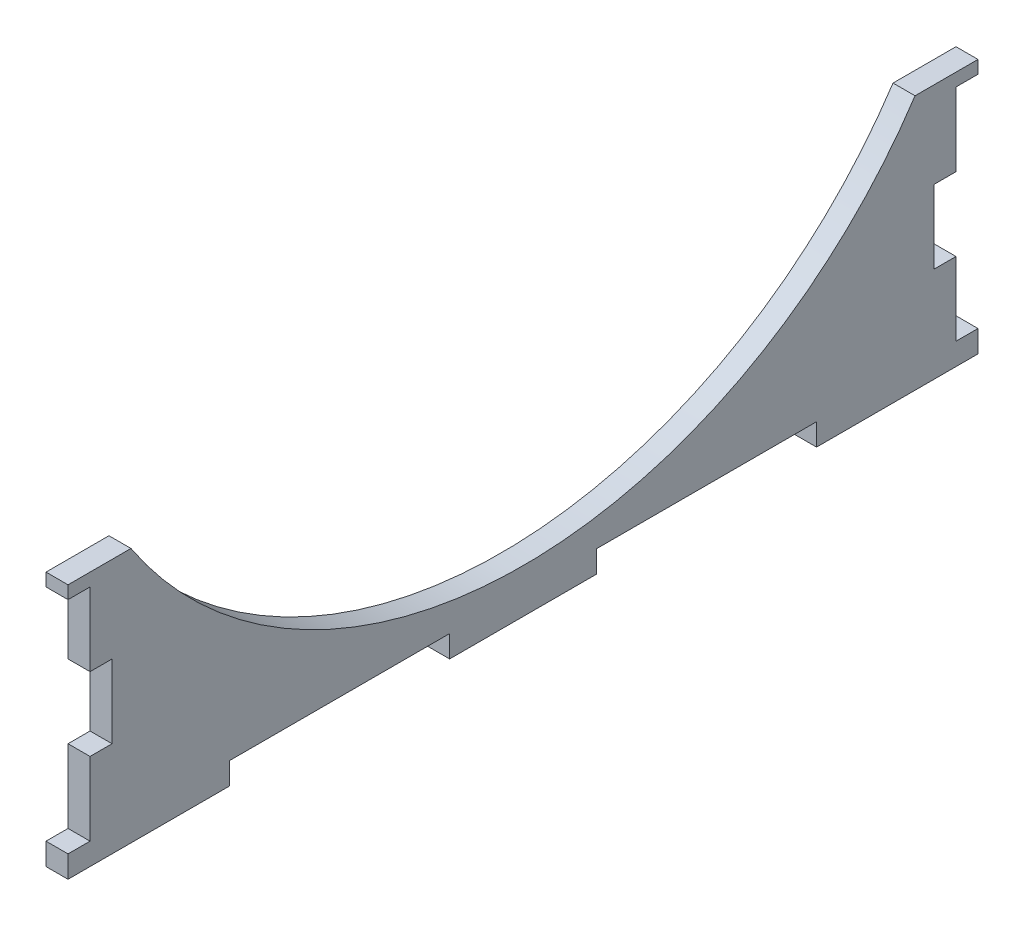
ISO-10303-21;
HEADER;
FILE_DESCRIPTION(('STEP AP214'),'2;1');
FILE_NAME('part.step','',(''),(''),'','','');
FILE_SCHEMA(('AUTOMOTIVE_DESIGN { 1 0 10303 214 1 1 1 1 }'));
ENDSEC;
DATA;
#1=APPLICATION_CONTEXT('core data for automotive mechanical design processes');
#2=APPLICATION_PROTOCOL_DEFINITION('international standard','automotive_design',2000,#1);
#3=PRODUCT_CONTEXT('',#1,'mechanical');
#4=PRODUCT('Part','Part','',(#3));
#5=PRODUCT_RELATED_PRODUCT_CATEGORY('part','',(#4));
#6=PRODUCT_DEFINITION_FORMATION('','',#4);
#7=PRODUCT_DEFINITION_CONTEXT('part definition',#1,'design');
#8=PRODUCT_DEFINITION('design','',#6,#7);
#9=PRODUCT_DEFINITION_SHAPE('','',#8);
#10=(LENGTH_UNIT() NAMED_UNIT(*) SI_UNIT(.MILLI.,.METRE.));
#11=(NAMED_UNIT(*) PLANE_ANGLE_UNIT() SI_UNIT($,.RADIAN.));
#12=(NAMED_UNIT(*) SI_UNIT($,.STERADIAN.) SOLID_ANGLE_UNIT());
#13=UNCERTAINTY_MEASURE_WITH_UNIT(LENGTH_MEASURE(1.E-05),#10,'distance_accuracy_value','');
#14=(GEOMETRIC_REPRESENTATION_CONTEXT(3) GLOBAL_UNCERTAINTY_ASSIGNED_CONTEXT((#13)) GLOBAL_UNIT_ASSIGNED_CONTEXT((#10,
#11,#12)) REPRESENTATION_CONTEXT('',''));
#15=CARTESIAN_POINT('',(0.,0.,0.));
#16=DIRECTION('',(0.,0.,1.));
#17=DIRECTION('',(1.,0.,0.));
#18=AXIS2_PLACEMENT_3D('',#15,#16,#17);
#19=CARTESIAN_POINT('',(-3.,0.,-3.00000000000028));
#20=DIRECTION('',(0.,0.,1.));
#21=DIRECTION('',(1.,0.,0.));
#22=AXIS2_PLACEMENT_3D('',#19,#20,#21);
#23=PLANE('',#22);
#24=DIRECTION('',(0.,-1.,0.));
#25=VECTOR('',#24,1.);
#26=CARTESIAN_POINT('',(0.,0.,-3.00000000000028));
#27=LINE('',#26,#25);
#28=CARTESIAN_POINT('',(0.,0.,-3.00000000000028));
#29=VERTEX_POINT('',#28);
#30=CARTESIAN_POINT('',(0.,-3.,-3.00000000000028));
#31=VERTEX_POINT('',#30);
#32=EDGE_CURVE('E266',#29,#31,#27,.T.);
#33=ORIENTED_EDGE('',*,*,#32,.T.);
#34=DIRECTION('',(1.,0.,0.));
#35=VECTOR('',#34,1.);
#36=CARTESIAN_POINT('',(-3.,-3.,-3.00000000000028));
#37=LINE('',#36,#35);
#38=CARTESIAN_POINT('',(-3.,-3.,-3.00000000000028));
#39=VERTEX_POINT('',#38);
#40=EDGE_CURVE('E11',#39,#31,#37,.T.);
#41=ORIENTED_EDGE('',*,*,#40,.F.);
#42=DIRECTION('',(0.,-1.,0.));
#43=VECTOR('',#42,1.);
#44=CARTESIAN_POINT('',(-3.,0.,-3.00000000000028));
#45=LINE('',#44,#43);
#46=CARTESIAN_POINT('',(-3.,0.,-3.00000000000028));
#47=VERTEX_POINT('',#46);
#48=EDGE_CURVE('E66',#47,#39,#45,.T.);
#49=ORIENTED_EDGE('',*,*,#48,.F.);
#50=DIRECTION('',(1.,0.,0.));
#51=VECTOR('',#50,1.);
#52=CARTESIAN_POINT('',(-3.,0.,-3.00000000000028));
#53=LINE('',#52,#51);
#54=EDGE_CURVE('E43',#47,#29,#53,.T.);
#55=ORIENTED_EDGE('',*,*,#54,.T.);
#56=EDGE_LOOP('',(#33,#41,#49,#55));
#57=FACE_BOUND('',#56,.T.);
#58=ADVANCED_FACE('F40',(#57),#23,.F.);
#59=CARTESIAN_POINT('',(-3.,-3.,0.));
#60=DIRECTION('',(0.,-1.,0.));
#61=DIRECTION('',(0.,0.,-1.));
#62=AXIS2_PLACEMENT_3D('',#59,#60,#61);
#63=PLANE('',#62);
#64=DIRECTION('',(0.,0.,-1.));
#65=VECTOR('',#64,1.);
#66=CARTESIAN_POINT('',(0.,-3.,0.));
#67=LINE('',#66,#65);
#68=CARTESIAN_POINT('',(0.,-3.,18.9999999999997));
#69=VERTEX_POINT('',#68);
#70=EDGE_CURVE('E361',#69,#31,#67,.T.);
#71=ORIENTED_EDGE('',*,*,#70,.F.);
#72=DIRECTION('',(1.,0.,0.));
#73=VECTOR('',#72,1.);
#74=CARTESIAN_POINT('',(-3.,-3.,18.9999999999997));
#75=LINE('',#74,#73);
#76=CARTESIAN_POINT('',(-3.,-3.,18.9999999999997));
#77=VERTEX_POINT('',#76);
#78=EDGE_CURVE('E49',#77,#69,#75,.T.);
#79=ORIENTED_EDGE('',*,*,#78,.F.);
#80=DIRECTION('',(0.,0.,-1.));
#81=VECTOR('',#80,1.);
#82=CARTESIAN_POINT('',(-3.,-3.,0.));
#83=LINE('',#82,#81);
#84=EDGE_CURVE('E251',#77,#39,#83,.T.);
#85=ORIENTED_EDGE('',*,*,#84,.T.);
#86=ORIENTED_EDGE('',*,*,#40,.T.);
#87=EDGE_LOOP('',(#71,#79,#85,#86));
#88=FACE_BOUND('',#87,.T.);
#89=ADVANCED_FACE('F457',(#88),#63,.T.);
#90=CARTESIAN_POINT('',(-3.,0.,18.9999999999997));
#91=DIRECTION('',(0.,0.,1.));
#92=DIRECTION('',(1.,0.,0.));
#93=AXIS2_PLACEMENT_3D('',#90,#91,#92);
#94=PLANE('',#93);
#95=DIRECTION('',(0.,-1.,0.));
#96=VECTOR('',#95,1.);
#97=CARTESIAN_POINT('',(0.,0.,18.9999999999997));
#98=LINE('',#97,#96);
#99=CARTESIAN_POINT('',(0.,0.,18.9999999999997));
#100=VERTEX_POINT('',#99);
#101=EDGE_CURVE('E237',#100,#69,#98,.T.);
#102=ORIENTED_EDGE('',*,*,#101,.F.);
#103=DIRECTION('',(1.,0.,0.));
#104=VECTOR('',#103,1.);
#105=CARTESIAN_POINT('',(-3.,0.,18.9999999999997));
#106=LINE('',#105,#104);
#107=CARTESIAN_POINT('',(-3.,0.,18.9999999999997));
#108=VERTEX_POINT('',#107);
#109=EDGE_CURVE('E232',#108,#100,#106,.T.);
#110=ORIENTED_EDGE('',*,*,#109,.F.);
#111=DIRECTION('',(0.,-1.,0.));
#112=VECTOR('',#111,1.);
#113=CARTESIAN_POINT('',(-3.,0.,18.9999999999997));
#114=LINE('',#113,#112);
#115=EDGE_CURVE('E235',#108,#77,#114,.T.);
#116=ORIENTED_EDGE('',*,*,#115,.T.);
#117=ORIENTED_EDGE('',*,*,#78,.T.);
#118=EDGE_LOOP('',(#102,#110,#116,#117));
#119=FACE_BOUND('',#118,.T.);
#120=ADVANCED_FACE('F234',(#119),#94,.T.);
#121=CARTESIAN_POINT('',(-3.,0.,0.));
#122=DIRECTION('',(0.,-1.,0.));
#123=DIRECTION('',(0.,0.,-1.));
#124=AXIS2_PLACEMENT_3D('',#121,#122,#123);
#125=PLANE('',#124);
#126=DIRECTION('',(0.,0.,-1.));
#127=VECTOR('',#126,1.);
#128=CARTESIAN_POINT('',(0.,0.,0.));
#129=LINE('',#128,#127);
#130=CARTESIAN_POINT('',(0.,0.,48.9999999999997));
#131=VERTEX_POINT('',#130);
#132=EDGE_CURVE('E356',#131,#100,#129,.T.);
#133=ORIENTED_EDGE('',*,*,#132,.F.);
#134=DIRECTION('',(1.,0.,0.));
#135=VECTOR('',#134,1.);
#136=CARTESIAN_POINT('',(-3.,0.,48.9999999999997));
#137=LINE('',#136,#135);
#138=CARTESIAN_POINT('',(-3.,0.,48.9999999999997));
#139=VERTEX_POINT('',#138);
#140=EDGE_CURVE('E243',#139,#131,#137,.T.);
#141=ORIENTED_EDGE('',*,*,#140,.F.);
#142=DIRECTION('',(0.,0.,-1.));
#143=VECTOR('',#142,1.);
#144=CARTESIAN_POINT('',(-3.,0.,0.));
#145=LINE('',#144,#143);
#146=EDGE_CURVE('E249',#139,#108,#145,.T.);
#147=ORIENTED_EDGE('',*,*,#146,.T.);
#148=ORIENTED_EDGE('',*,*,#109,.T.);
#149=EDGE_LOOP('',(#133,#141,#147,#148));
#150=FACE_BOUND('',#149,.T.);
#151=ADVANCED_FACE('F254',(#150),#125,.T.);
#152=CARTESIAN_POINT('',(-3.,0.,48.9999999999997));
#153=DIRECTION('',(0.,0.,-1.));
#154=DIRECTION('',(-1.,0.,0.));
#155=AXIS2_PLACEMENT_3D('',#152,#153,#154);
#156=PLANE('',#155);
#157=DIRECTION('',(0.,1.,0.));
#158=VECTOR('',#157,1.);
#159=CARTESIAN_POINT('',(0.,0.,48.9999999999997));
#160=LINE('',#159,#158);
#161=CARTESIAN_POINT('',(0.,-3.,48.9999999999997));
#162=VERTEX_POINT('',#161);
#163=EDGE_CURVE('E352',#162,#131,#160,.T.);
#164=ORIENTED_EDGE('',*,*,#163,.F.);
#165=DIRECTION('',(1.,0.,0.));
#166=VECTOR('',#165,1.);
#167=CARTESIAN_POINT('',(-3.,-3.,48.9999999999997));
#168=LINE('',#167,#166);
#169=CARTESIAN_POINT('',(-3.,-3.,48.9999999999997));
#170=VERTEX_POINT('',#169);
#171=EDGE_CURVE('E369',#170,#162,#168,.T.);
#172=ORIENTED_EDGE('',*,*,#171,.F.);
#173=DIRECTION('',(0.,1.,0.));
#174=VECTOR('',#173,1.);
#175=CARTESIAN_POINT('',(-3.,0.,48.9999999999997));
#176=LINE('',#175,#174);
#177=EDGE_CURVE('E256',#170,#139,#176,.T.);
#178=ORIENTED_EDGE('',*,*,#177,.T.);
#179=ORIENTED_EDGE('',*,*,#140,.T.);
#180=EDGE_LOOP('',(#164,#172,#178,#179));
#181=FACE_BOUND('',#180,.T.);
#182=ADVANCED_FACE('F470',(#181),#156,.T.);
#183=CARTESIAN_POINT('',(-3.,-3.,0.));
#184=DIRECTION('',(0.,-1.,0.));
#185=DIRECTION('',(0.,0.,-1.));
#186=AXIS2_PLACEMENT_3D('',#183,#184,#185);
#187=PLANE('',#186);
#188=DIRECTION('',(0.,0.,-1.));
#189=VECTOR('',#188,1.);
#190=CARTESIAN_POINT('',(0.,-3.,0.));
#191=LINE('',#190,#189);
#192=CARTESIAN_POINT('',(0.,-3.,68.9999999999997));
#193=VERTEX_POINT('',#192);
#194=EDGE_CURVE('E348',#193,#162,#191,.T.);
#195=ORIENTED_EDGE('',*,*,#194,.F.);
#196=DIRECTION('',(1.,0.,0.));
#197=VECTOR('',#196,1.);
#198=CARTESIAN_POINT('',(-3.,-3.,68.9999999999997));
#199=LINE('',#198,#197);
#200=CARTESIAN_POINT('',(-3.,-3.,68.9999999999997));
#201=VERTEX_POINT('',#200);
#202=EDGE_CURVE('E372',#201,#193,#199,.T.);
#203=ORIENTED_EDGE('',*,*,#202,.F.);
#204=DIRECTION('',(0.,0.,-1.));
#205=VECTOR('',#204,1.);
#206=CARTESIAN_POINT('',(-3.,-3.,0.));
#207=LINE('',#206,#205);
#208=EDGE_CURVE('E260',#201,#170,#207,.T.);
#209=ORIENTED_EDGE('',*,*,#208,.T.);
#210=ORIENTED_EDGE('',*,*,#171,.T.);
#211=EDGE_LOOP('',(#195,#203,#209,#210));
#212=FACE_BOUND('',#211,.T.);
#213=ADVANCED_FACE('F473',(#212),#187,.T.);
#214=CARTESIAN_POINT('',(-3.,0.,68.9999999999997));
#215=DIRECTION('',(0.,0.,1.));
#216=DIRECTION('',(1.,0.,0.));
#217=AXIS2_PLACEMENT_3D('',#214,#215,#216);
#218=PLANE('',#217);
#219=DIRECTION('',(0.,-1.,0.));
#220=VECTOR('',#219,1.);
#221=CARTESIAN_POINT('',(0.,0.,68.9999999999997));
#222=LINE('',#221,#220);
#223=CARTESIAN_POINT('',(0.,0.,68.9999999999997));
#224=VERTEX_POINT('',#223);
#225=EDGE_CURVE('E344',#224,#193,#222,.T.);
#226=ORIENTED_EDGE('',*,*,#225,.F.);
#227=DIRECTION('',(1.,0.,0.));
#228=VECTOR('',#227,1.);
#229=CARTESIAN_POINT('',(-3.,0.,68.9999999999997));
#230=LINE('',#229,#228);
#231=CARTESIAN_POINT('',(-3.,0.,68.9999999999997));
#232=VERTEX_POINT('',#231);
#233=EDGE_CURVE('E375',#232,#224,#230,.T.);
#234=ORIENTED_EDGE('',*,*,#233,.F.);
#235=DIRECTION('',(0.,-1.,0.));
#236=VECTOR('',#235,1.);
#237=CARTESIAN_POINT('',(-3.,0.,68.9999999999997));
#238=LINE('',#237,#236);
#239=EDGE_CURVE('E630',#232,#201,#238,.T.);
#240=ORIENTED_EDGE('',*,*,#239,.T.);
#241=ORIENTED_EDGE('',*,*,#202,.T.);
#242=EDGE_LOOP('',(#226,#234,#240,#241));
#243=FACE_BOUND('',#242,.T.);
#244=ADVANCED_FACE('F477',(#243),#218,.T.);
#245=CARTESIAN_POINT('',(-3.,0.,0.));
#246=DIRECTION('',(0.,-1.,0.));
#247=DIRECTION('',(0.,0.,-1.));
#248=AXIS2_PLACEMENT_3D('',#245,#246,#247);
#249=PLANE('',#248);
#250=DIRECTION('',(0.,0.,-1.));
#251=VECTOR('',#250,1.);
#252=CARTESIAN_POINT('',(0.,0.,0.));
#253=LINE('',#252,#251);
#254=CARTESIAN_POINT('',(0.,0.,98.9999999999997));
#255=VERTEX_POINT('',#254);
#256=EDGE_CURVE('E340',#255,#224,#253,.T.);
#257=ORIENTED_EDGE('',*,*,#256,.F.);
#258=DIRECTION('',(1.,0.,0.));
#259=VECTOR('',#258,1.);
#260=CARTESIAN_POINT('',(-3.,0.,98.9999999999997));
#261=LINE('',#260,#259);
#262=CARTESIAN_POINT('',(-3.,0.,98.9999999999997));
#263=VERTEX_POINT('',#262);
#264=EDGE_CURVE('E378',#263,#255,#261,.T.);
#265=ORIENTED_EDGE('',*,*,#264,.F.);
#266=DIRECTION('',(0.,0.,-1.));
#267=VECTOR('',#266,1.);
#268=CARTESIAN_POINT('',(-3.,0.,0.));
#269=LINE('',#268,#267);
#270=EDGE_CURVE('E626',#263,#232,#269,.T.);
#271=ORIENTED_EDGE('',*,*,#270,.T.);
#272=ORIENTED_EDGE('',*,*,#233,.T.);
#273=EDGE_LOOP('',(#257,#265,#271,#272));
#274=FACE_BOUND('',#273,.T.);
#275=ADVANCED_FACE('F481',(#274),#249,.T.);
#276=CARTESIAN_POINT('',(-3.,0.,98.9999999999997));
#277=DIRECTION('',(0.,0.,1.));
#278=DIRECTION('',(1.,0.,0.));
#279=AXIS2_PLACEMENT_3D('',#276,#277,#278);
#280=PLANE('',#279);
#281=DIRECTION('',(0.,-1.,0.));
#282=VECTOR('',#281,1.);
#283=CARTESIAN_POINT('',(0.,0.,98.9999999999997));
#284=LINE('',#283,#282);
#285=CARTESIAN_POINT('',(0.,-3.,98.9999999999997));
#286=VERTEX_POINT('',#285);
#287=EDGE_CURVE('E337',#255,#286,#284,.T.);
#288=ORIENTED_EDGE('',*,*,#287,.T.);
#289=DIRECTION('',(1.,0.,0.));
#290=VECTOR('',#289,1.);
#291=CARTESIAN_POINT('',(-3.,-3.,98.9999999999997));
#292=LINE('',#291,#290);
#293=CARTESIAN_POINT('',(-3.,-3.,98.9999999999997));
#294=VERTEX_POINT('',#293);
#295=EDGE_CURVE('E381',#294,#286,#292,.T.);
#296=ORIENTED_EDGE('',*,*,#295,.F.);
#297=DIRECTION('',(0.,-1.,0.));
#298=VECTOR('',#297,1.);
#299=CARTESIAN_POINT('',(-3.,0.,98.9999999999997));
#300=LINE('',#299,#298);
#301=EDGE_CURVE('E623',#263,#294,#300,.T.);
#302=ORIENTED_EDGE('',*,*,#301,.F.);
#303=ORIENTED_EDGE('',*,*,#264,.T.);
#304=EDGE_LOOP('',(#288,#296,#302,#303));
#305=FACE_BOUND('',#304,.T.);
#306=ADVANCED_FACE('F485',(#305),#280,.F.);
#307=CARTESIAN_POINT('',(-3.,-3.,0.));
#308=DIRECTION('',(0.,1.,0.));
#309=DIRECTION('',(0.,0.,1.));
#310=AXIS2_PLACEMENT_3D('',#307,#308,#309);
#311=PLANE('',#310);
#312=DIRECTION('',(0.,0.,1.));
#313=VECTOR('',#312,1.);
#314=CARTESIAN_POINT('',(0.,-3.,0.));
#315=LINE('',#314,#313);
#316=CARTESIAN_POINT('',(0.,-3.,121.));
#317=VERTEX_POINT('',#316);
#318=EDGE_CURVE('E334',#286,#317,#315,.T.);
#319=ORIENTED_EDGE('',*,*,#318,.T.);
#320=DIRECTION('',(1.,0.,0.));
#321=VECTOR('',#320,1.);
#322=CARTESIAN_POINT('',(-3.,-3.,121.));
#323=LINE('',#322,#321);
#324=CARTESIAN_POINT('',(-3.,-3.,121.));
#325=VERTEX_POINT('',#324);
#326=EDGE_CURVE('E385',#325,#317,#323,.T.);
#327=ORIENTED_EDGE('',*,*,#326,.F.);
#328=DIRECTION('',(0.,0.,1.));
#329=VECTOR('',#328,1.);
#330=CARTESIAN_POINT('',(-3.,-3.,0.));
#331=LINE('',#330,#329);
#332=EDGE_CURVE('E620',#294,#325,#331,.T.);
#333=ORIENTED_EDGE('',*,*,#332,.F.);
#334=ORIENTED_EDGE('',*,*,#295,.T.);
#335=EDGE_LOOP('',(#319,#327,#333,#334));
#336=FACE_BOUND('',#335,.T.);
#337=ADVANCED_FACE('F489',(#336),#311,.F.);
#338=CARTESIAN_POINT('',(-3.,0.,121.));
#339=DIRECTION('',(0.,0.,-1.));
#340=DIRECTION('',(-1.,0.,0.));
#341=AXIS2_PLACEMENT_3D('',#338,#339,#340);
#342=PLANE('',#341);
#343=DIRECTION('',(0.,1.,0.));
#344=VECTOR('',#343,1.);
#345=CARTESIAN_POINT('',(0.,0.,121.));
#346=LINE('',#345,#344);
#347=CARTESIAN_POINT('',(0.,0.,121.));
#348=VERTEX_POINT('',#347);
#349=EDGE_CURVE('E331',#317,#348,#346,.T.);
#350=ORIENTED_EDGE('',*,*,#349,.T.);
#351=DIRECTION('',(1.,0.,0.));
#352=VECTOR('',#351,1.);
#353=CARTESIAN_POINT('',(-3.,0.,121.));
#354=LINE('',#353,#352);
#355=CARTESIAN_POINT('',(-3.,0.,121.));
#356=VERTEX_POINT('',#355);
#357=EDGE_CURVE('E389',#356,#348,#354,.T.);
#358=ORIENTED_EDGE('',*,*,#357,.F.);
#359=DIRECTION('',(0.,1.,0.));
#360=VECTOR('',#359,1.);
#361=CARTESIAN_POINT('',(-3.,0.,121.));
#362=LINE('',#361,#360);
#363=EDGE_CURVE('E617',#325,#356,#362,.T.);
#364=ORIENTED_EDGE('',*,*,#363,.F.);
#365=ORIENTED_EDGE('',*,*,#326,.T.);
#366=EDGE_LOOP('',(#350,#358,#364,#365));
#367=FACE_BOUND('',#366,.T.);
#368=ADVANCED_FACE('F493',(#367),#342,.F.);
#369=CARTESIAN_POINT('',(-3.,0.,0.));
#370=DIRECTION('',(0.,-1.,0.));
#371=DIRECTION('',(0.,0.,-1.));
#372=AXIS2_PLACEMENT_3D('',#369,#370,#371);
#373=PLANE('',#372);
#374=DIRECTION('',(0.,0.,-1.));
#375=VECTOR('',#374,1.);
#376=CARTESIAN_POINT('',(0.,0.,0.));
#377=LINE('',#376,#375);
#378=CARTESIAN_POINT('',(0.,0.,117.999999999999));
#379=VERTEX_POINT('',#378);
#380=EDGE_CURVE('E327',#348,#379,#377,.T.);
#381=ORIENTED_EDGE('',*,*,#380,.T.);
#382=DIRECTION('',(1.,0.,0.));
#383=VECTOR('',#382,1.);
#384=CARTESIAN_POINT('',(-3.,0.,117.999999999999));
#385=LINE('',#384,#383);
#386=CARTESIAN_POINT('',(-3.,0.,117.999999999999));
#387=VERTEX_POINT('',#386);
#388=EDGE_CURVE('E393',#387,#379,#385,.T.);
#389=ORIENTED_EDGE('',*,*,#388,.F.);
#390=DIRECTION('',(0.,0.,-1.));
#391=VECTOR('',#390,1.);
#392=CARTESIAN_POINT('',(-3.,0.,0.));
#393=LINE('',#392,#391);
#394=EDGE_CURVE('E614',#356,#387,#393,.T.);
#395=ORIENTED_EDGE('',*,*,#394,.F.);
#396=ORIENTED_EDGE('',*,*,#357,.T.);
#397=EDGE_LOOP('',(#381,#389,#395,#396));
#398=FACE_BOUND('',#397,.T.);
#399=ADVANCED_FACE('F497',(#398),#373,.F.);
#400=CARTESIAN_POINT('',(-3.,0.,117.999999999999));
#401=DIRECTION('',(0.,0.,1.));
#402=DIRECTION('',(1.,0.,0.));
#403=AXIS2_PLACEMENT_3D('',#400,#401,#402);
#404=PLANE('',#403);
#405=DIRECTION('',(0.,-1.,0.));
#406=VECTOR('',#405,1.);
#407=CARTESIAN_POINT('',(0.,0.,117.999999999999));
#408=LINE('',#407,#406);
#409=CARTESIAN_POINT('',(0.,9.99959895685082,117.999999999999));
#410=VERTEX_POINT('',#409);
#411=EDGE_CURVE('E323',#410,#379,#408,.T.);
#412=ORIENTED_EDGE('',*,*,#411,.F.);
#413=DIRECTION('',(1.,0.,0.));
#414=VECTOR('',#413,1.);
#415=CARTESIAN_POINT('',(-3.,9.99959895685082,117.999999999999));
#416=LINE('',#415,#414);
#417=CARTESIAN_POINT('',(-3.,9.99959895685082,117.999999999999));
#418=VERTEX_POINT('',#417);
#419=EDGE_CURVE('E396',#418,#410,#416,.T.);
#420=ORIENTED_EDGE('',*,*,#419,.F.);
#421=DIRECTION('',(0.,-1.,0.));
#422=VECTOR('',#421,1.);
#423=CARTESIAN_POINT('',(-3.,0.,117.999999999999));
#424=LINE('',#423,#422);
#425=EDGE_CURVE('E610',#418,#387,#424,.T.);
#426=ORIENTED_EDGE('',*,*,#425,.T.);
#427=ORIENTED_EDGE('',*,*,#388,.T.);
#428=EDGE_LOOP('',(#412,#420,#426,#427));
#429=FACE_BOUND('',#428,.T.);
#430=ADVANCED_FACE('F501',(#429),#404,.T.);
#431=CARTESIAN_POINT('',(-3.,9.99959895685082,0.));
#432=DIRECTION('',(0.,-1.,0.));
#433=DIRECTION('',(0.,0.,-1.));
#434=AXIS2_PLACEMENT_3D('',#431,#432,#433);
#435=PLANE('',#434);
#436=DIRECTION('',(0.,0.,-1.));
#437=VECTOR('',#436,1.);
#438=CARTESIAN_POINT('',(0.,9.99959895685082,0.));
#439=LINE('',#438,#437);
#440=CARTESIAN_POINT('',(0.,9.99959895685082,114.999999999999));
#441=VERTEX_POINT('',#440);
#442=EDGE_CURVE('E319',#410,#441,#439,.T.);
#443=ORIENTED_EDGE('',*,*,#442,.T.);
#444=DIRECTION('',(1.,0.,0.));
#445=VECTOR('',#444,1.);
#446=CARTESIAN_POINT('',(-3.,9.99959895685082,114.999999999999));
#447=LINE('',#446,#445);
#448=CARTESIAN_POINT('',(-3.,9.99959895685082,114.999999999999));
#449=VERTEX_POINT('',#448);
#450=EDGE_CURVE('E399',#449,#441,#447,.T.);
#451=ORIENTED_EDGE('',*,*,#450,.F.);
#452=DIRECTION('',(0.,0.,-1.));
#453=VECTOR('',#452,1.);
#454=CARTESIAN_POINT('',(-3.,9.99959895685082,0.));
#455=LINE('',#454,#453);
#456=EDGE_CURVE('E607',#418,#449,#455,.T.);
#457=ORIENTED_EDGE('',*,*,#456,.F.);
#458=ORIENTED_EDGE('',*,*,#419,.T.);
#459=EDGE_LOOP('',(#443,#451,#457,#458));
#460=FACE_BOUND('',#459,.T.);
#461=ADVANCED_FACE('F505',(#460),#435,.F.);
#462=CARTESIAN_POINT('',(-3.,0.,114.999999999999));
#463=DIRECTION('',(0.,0.,1.));
#464=DIRECTION('',(1.,0.,0.));
#465=AXIS2_PLACEMENT_3D('',#462,#463,#464);
#466=PLANE('',#465);
#467=DIRECTION('',(0.,-1.,0.));
#468=VECTOR('',#467,1.);
#469=CARTESIAN_POINT('',(0.,0.,114.999999999999));
#470=LINE('',#469,#468);
#471=CARTESIAN_POINT('',(0.,20.0004010431492,114.999999999999));
#472=VERTEX_POINT('',#471);
#473=EDGE_CURVE('E315',#472,#441,#470,.T.);
#474=ORIENTED_EDGE('',*,*,#473,.F.);
#475=DIRECTION('',(1.,0.,0.));
#476=VECTOR('',#475,1.);
#477=CARTESIAN_POINT('',(-3.,20.0004010431492,114.999999999999));
#478=LINE('',#477,#476);
#479=CARTESIAN_POINT('',(-3.,20.0004010431492,114.999999999999));
#480=VERTEX_POINT('',#479);
#481=EDGE_CURVE('E402',#480,#472,#478,.T.);
#482=ORIENTED_EDGE('',*,*,#481,.F.);
#483=DIRECTION('',(0.,-1.,0.));
#484=VECTOR('',#483,1.);
#485=CARTESIAN_POINT('',(-3.,0.,114.999999999999));
#486=LINE('',#485,#484);
#487=EDGE_CURVE('E603',#480,#449,#486,.T.);
#488=ORIENTED_EDGE('',*,*,#487,.T.);
#489=ORIENTED_EDGE('',*,*,#450,.T.);
#490=EDGE_LOOP('',(#474,#482,#488,#489));
#491=FACE_BOUND('',#490,.T.);
#492=ADVANCED_FACE('F509',(#491),#466,.T.);
#493=CARTESIAN_POINT('',(-3.,20.0004010431492,0.));
#494=DIRECTION('',(0.,-1.,0.));
#495=DIRECTION('',(0.,0.,-1.));
#496=AXIS2_PLACEMENT_3D('',#493,#494,#495);
#497=PLANE('',#496);
#498=DIRECTION('',(0.,0.,-1.));
#499=VECTOR('',#498,1.);
#500=CARTESIAN_POINT('',(0.,20.0004010431492,0.));
#501=LINE('',#500,#499);
#502=CARTESIAN_POINT('',(0.,20.0004010431492,118.));
#503=VERTEX_POINT('',#502);
#504=EDGE_CURVE('E311',#503,#472,#501,.T.);
#505=ORIENTED_EDGE('',*,*,#504,.F.);
#506=DIRECTION('',(1.,0.,0.));
#507=VECTOR('',#506,1.);
#508=CARTESIAN_POINT('',(-3.,20.0004010431492,118.));
#509=LINE('',#508,#507);
#510=CARTESIAN_POINT('',(-3.,20.0004010431492,118.));
#511=VERTEX_POINT('',#510);
#512=EDGE_CURVE('E405',#511,#503,#509,.T.);
#513=ORIENTED_EDGE('',*,*,#512,.F.);
#514=DIRECTION('',(0.,0.,-1.));
#515=VECTOR('',#514,1.);
#516=CARTESIAN_POINT('',(-3.,20.0004010431492,0.));
#517=LINE('',#516,#515);
#518=EDGE_CURVE('E599',#511,#480,#517,.T.);
#519=ORIENTED_EDGE('',*,*,#518,.T.);
#520=ORIENTED_EDGE('',*,*,#481,.T.);
#521=EDGE_LOOP('',(#505,#513,#519,#520));
#522=FACE_BOUND('',#521,.T.);
#523=ADVANCED_FACE('F513',(#522),#497,.T.);
#524=CARTESIAN_POINT('',(-3.,0.,118.));
#525=DIRECTION('',(0.,0.,1.));
#526=DIRECTION('',(1.,0.,0.));
#527=AXIS2_PLACEMENT_3D('',#524,#525,#526);
#528=PLANE('',#527);
#529=DIRECTION('',(0.,-1.,0.));
#530=VECTOR('',#529,1.);
#531=CARTESIAN_POINT('',(0.,0.,118.));
#532=LINE('',#531,#530);
#533=CARTESIAN_POINT('',(0.,30.,118.));
#534=VERTEX_POINT('',#533);
#535=EDGE_CURVE('E307',#534,#503,#532,.T.);
#536=ORIENTED_EDGE('',*,*,#535,.F.);
#537=DIRECTION('',(1.,0.,0.));
#538=VECTOR('',#537,1.);
#539=CARTESIAN_POINT('',(-3.,30.,118.));
#540=LINE('',#539,#538);
#541=CARTESIAN_POINT('',(-3.,30.,118.));
#542=VERTEX_POINT('',#541);
#543=EDGE_CURVE('E408',#542,#534,#540,.T.);
#544=ORIENTED_EDGE('',*,*,#543,.F.);
#545=DIRECTION('',(0.,-1.,0.));
#546=VECTOR('',#545,1.);
#547=CARTESIAN_POINT('',(-3.,0.,118.));
#548=LINE('',#547,#546);
#549=EDGE_CURVE('E595',#542,#511,#548,.T.);
#550=ORIENTED_EDGE('',*,*,#549,.T.);
#551=ORIENTED_EDGE('',*,*,#512,.T.);
#552=EDGE_LOOP('',(#536,#544,#550,#551));
#553=FACE_BOUND('',#552,.T.);
#554=ADVANCED_FACE('F517',(#553),#528,.T.);
#555=CARTESIAN_POINT('',(-3.,30.,0.));
#556=DIRECTION('',(0.,1.,0.));
#557=DIRECTION('',(0.,0.,1.));
#558=AXIS2_PLACEMENT_3D('',#555,#556,#557);
#559=PLANE('',#558);
#560=DIRECTION('',(0.,0.,1.));
#561=VECTOR('',#560,1.);
#562=CARTESIAN_POINT('',(0.,30.,0.));
#563=LINE('',#562,#561);
#564=CARTESIAN_POINT('',(0.,30.,121.));
#565=VERTEX_POINT('',#564);
#566=EDGE_CURVE('E304',#534,#565,#563,.T.);
#567=ORIENTED_EDGE('',*,*,#566,.T.);
#568=DIRECTION('',(1.,0.,0.));
#569=VECTOR('',#568,1.);
#570=CARTESIAN_POINT('',(-3.,30.,121.));
#571=LINE('',#570,#569);
#572=CARTESIAN_POINT('',(-3.,30.,121.));
#573=VERTEX_POINT('',#572);
#574=EDGE_CURVE('E411',#573,#565,#571,.T.);
#575=ORIENTED_EDGE('',*,*,#574,.F.);
#576=DIRECTION('',(0.,0.,1.));
#577=VECTOR('',#576,1.);
#578=CARTESIAN_POINT('',(-3.,30.,0.));
#579=LINE('',#578,#577);
#580=EDGE_CURVE('E592',#542,#573,#579,.T.);
#581=ORIENTED_EDGE('',*,*,#580,.F.);
#582=ORIENTED_EDGE('',*,*,#543,.T.);
#583=EDGE_LOOP('',(#567,#575,#581,#582));
#584=FACE_BOUND('',#583,.T.);
#585=ADVANCED_FACE('F521',(#584),#559,.F.);
#586=CARTESIAN_POINT('',(-3.,0.,121.));
#587=DIRECTION('',(0.,0.,-1.));
#588=DIRECTION('',(-1.,0.,0.));
#589=AXIS2_PLACEMENT_3D('',#586,#587,#588);
#590=PLANE('',#589);
#591=DIRECTION('',(0.,1.,0.));
#592=VECTOR('',#591,1.);
#593=CARTESIAN_POINT('',(0.,0.,121.));
#594=LINE('',#593,#592);
#595=CARTESIAN_POINT('',(0.,31.7541567897681,121.));
#596=VERTEX_POINT('',#595);
#597=EDGE_CURVE('E300',#565,#596,#594,.T.);
#598=ORIENTED_EDGE('',*,*,#597,.T.);
#599=DIRECTION('',(1.,0.,0.));
#600=VECTOR('',#599,1.);
#601=CARTESIAN_POINT('',(-3.,31.7541567897681,121.));
#602=LINE('',#601,#600);
#603=CARTESIAN_POINT('',(-3.,31.7541567897681,121.));
#604=VERTEX_POINT('',#603);
#605=EDGE_CURVE('E270',#604,#596,#602,.T.);
#606=ORIENTED_EDGE('',*,*,#605,.F.);
#607=DIRECTION('',(0.,1.,0.));
#608=VECTOR('',#607,1.);
#609=CARTESIAN_POINT('',(-3.,0.,121.));
#610=LINE('',#609,#608);
#611=EDGE_CURVE('E589',#573,#604,#610,.T.);
#612=ORIENTED_EDGE('',*,*,#611,.F.);
#613=ORIENTED_EDGE('',*,*,#574,.T.);
#614=EDGE_LOOP('',(#598,#606,#612,#613));
#615=FACE_BOUND('',#614,.T.);
#616=ADVANCED_FACE('F525',(#615),#590,.F.);
#617=CARTESIAN_POINT('',(-3.,0.,-3.00000000000028));
#618=DIRECTION('',(0.,0.,-1.));
#619=DIRECTION('',(-1.,0.,0.));
#620=AXIS2_PLACEMENT_3D('',#617,#618,#619);
#621=PLANE('',#620);
#622=DIRECTION('',(1.,0.,0.));
#623=VECTOR('',#622,1.);
#624=CARTESIAN_POINT('',(-3.,31.7541567897681,-3.00000000000028));
#625=LINE('',#624,#623);
#626=CARTESIAN_POINT('',(-3.,31.7541567897681,-3.00000000000028));
#627=VERTEX_POINT('',#626);
#628=CARTESIAN_POINT('',(0.,31.7541567897681,-3.00000000000028));
#629=VERTEX_POINT('',#628);
#630=EDGE_CURVE('E677',#627,#629,#625,.T.);
#631=ORIENTED_EDGE('',*,*,#630,.T.);
#632=DIRECTION('',(0.,1.,0.));
#633=VECTOR('',#632,1.);
#634=CARTESIAN_POINT('',(0.,0.,-3.00000000000028));
#635=LINE('',#634,#633);
#636=CARTESIAN_POINT('',(0.,30.,-3.00000000000028));
#637=VERTEX_POINT('',#636);
#638=EDGE_CURVE('E296',#637,#629,#635,.T.);
#639=ORIENTED_EDGE('',*,*,#638,.F.);
#640=DIRECTION('',(1.,0.,0.));
#641=VECTOR('',#640,1.);
#642=CARTESIAN_POINT('',(-3.,30.,-3.00000000000028));
#643=LINE('',#642,#641);
#644=CARTESIAN_POINT('',(-3.,30.,-3.00000000000028));
#645=VERTEX_POINT('',#644);
#646=EDGE_CURVE('E415',#645,#637,#643,.T.);
#647=ORIENTED_EDGE('',*,*,#646,.F.);
#648=DIRECTION('',(0.,1.,0.));
#649=VECTOR('',#648,1.);
#650=CARTESIAN_POINT('',(-3.,0.,-3.00000000000028));
#651=LINE('',#650,#649);
#652=EDGE_CURVE('E585',#645,#627,#651,.T.);
#653=ORIENTED_EDGE('',*,*,#652,.T.);
#654=EDGE_LOOP('',(#631,#639,#647,#653));
#655=FACE_BOUND('',#654,.T.);
#656=ADVANCED_FACE('F529',(#655),#621,.T.);
#657=CARTESIAN_POINT('',(-3.,30.,0.));
#658=DIRECTION('',(0.,-1.,0.));
#659=DIRECTION('',(0.,0.,-1.));
#660=AXIS2_PLACEMENT_3D('',#657,#658,#659);
#661=PLANE('',#660);
#662=DIRECTION('',(0.,0.,-1.));
#663=VECTOR('',#662,1.);
#664=CARTESIAN_POINT('',(0.,30.,0.));
#665=LINE('',#664,#663);
#666=CARTESIAN_POINT('',(0.,30.,0.));
#667=VERTEX_POINT('',#666);
#668=EDGE_CURVE('E292',#667,#637,#665,.T.);
#669=ORIENTED_EDGE('',*,*,#668,.F.);
#670=DIRECTION('',(1.,0.,0.));
#671=VECTOR('',#670,1.);
#672=CARTESIAN_POINT('',(-3.,30.,0.));
#673=LINE('',#672,#671);
#674=CARTESIAN_POINT('',(-3.,30.,0.));
#675=VERTEX_POINT('',#674);
#676=EDGE_CURVE('E418',#675,#667,#673,.T.);
#677=ORIENTED_EDGE('',*,*,#676,.F.);
#678=DIRECTION('',(0.,0.,-1.));
#679=VECTOR('',#678,1.);
#680=CARTESIAN_POINT('',(-3.,30.,0.));
#681=LINE('',#680,#679);
#682=EDGE_CURVE('E581',#675,#645,#681,.T.);
#683=ORIENTED_EDGE('',*,*,#682,.T.);
#684=ORIENTED_EDGE('',*,*,#646,.T.);
#685=EDGE_LOOP('',(#669,#677,#683,#684));
#686=FACE_BOUND('',#685,.T.);
#687=ADVANCED_FACE('F533',(#686),#661,.T.);
#688=CARTESIAN_POINT('',(-3.,0.,0.));
#689=DIRECTION('',(0.,0.,1.));
#690=DIRECTION('',(0.,-1.,0.));
#691=AXIS2_PLACEMENT_3D('',#688,#689,#690);
#692=PLANE('',#691);
#693=DIRECTION('',(0.,-1.,0.));
#694=VECTOR('',#693,1.);
#695=CARTESIAN_POINT('',(0.,0.,0.));
#696=LINE('',#695,#694);
#697=CARTESIAN_POINT('',(0.,20.0004010431491,0.));
#698=VERTEX_POINT('',#697);
#699=EDGE_CURVE('E289',#667,#698,#696,.T.);
#700=ORIENTED_EDGE('',*,*,#699,.T.);
#701=DIRECTION('',(1.,0.,0.));
#702=VECTOR('',#701,1.);
#703=CARTESIAN_POINT('',(-3.,20.0004010431491,0.));
#704=LINE('',#703,#702);
#705=CARTESIAN_POINT('',(-3.,20.0004010431491,0.));
#706=VERTEX_POINT('',#705);
#707=EDGE_CURVE('E421',#706,#698,#704,.T.);
#708=ORIENTED_EDGE('',*,*,#707,.F.);
#709=DIRECTION('',(0.,-1.,0.));
#710=VECTOR('',#709,1.);
#711=CARTESIAN_POINT('',(-3.,0.,0.));
#712=LINE('',#711,#710);
#713=EDGE_CURVE('E578',#675,#706,#712,.T.);
#714=ORIENTED_EDGE('',*,*,#713,.F.);
#715=ORIENTED_EDGE('',*,*,#676,.T.);
#716=EDGE_LOOP('',(#700,#708,#714,#715));
#717=FACE_BOUND('',#716,.T.);
#718=ADVANCED_FACE('F537',(#717),#692,.F.);
#719=CARTESIAN_POINT('',(-3.,20.0004010431491,0.));
#720=DIRECTION('',(0.,1.,0.));
#721=DIRECTION('',(0.,0.,1.));
#722=AXIS2_PLACEMENT_3D('',#719,#720,#721);
#723=PLANE('',#722);
#724=DIRECTION('',(0.,0.,1.));
#725=VECTOR('',#724,1.);
#726=CARTESIAN_POINT('',(0.,20.0004010431491,0.));
#727=LINE('',#726,#725);
#728=CARTESIAN_POINT('',(0.,20.0004010431491,3.00000000000028));
#729=VERTEX_POINT('',#728);
#730=EDGE_CURVE('E286',#698,#729,#727,.T.);
#731=ORIENTED_EDGE('',*,*,#730,.T.);
#732=DIRECTION('',(1.,0.,0.));
#733=VECTOR('',#732,1.);
#734=CARTESIAN_POINT('',(-3.,20.0004010431491,3.00000000000028));
#735=LINE('',#734,#733);
#736=CARTESIAN_POINT('',(-3.,20.0004010431491,3.00000000000028));
#737=VERTEX_POINT('',#736);
#738=EDGE_CURVE('E425',#737,#729,#735,.T.);
#739=ORIENTED_EDGE('',*,*,#738,.F.);
#740=DIRECTION('',(0.,0.,1.));
#741=VECTOR('',#740,1.);
#742=CARTESIAN_POINT('',(-3.,20.0004010431491,0.));
#743=LINE('',#742,#741);
#744=EDGE_CURVE('E572',#706,#737,#743,.T.);
#745=ORIENTED_EDGE('',*,*,#744,.F.);
#746=ORIENTED_EDGE('',*,*,#707,.T.);
#747=EDGE_LOOP('',(#731,#739,#745,#746));
#748=FACE_BOUND('',#747,.T.);
#749=ADVANCED_FACE('F541',(#748),#723,.F.);
#750=CARTESIAN_POINT('',(-3.,0.,3.00000000000028));
#751=DIRECTION('',(0.,0.,1.));
#752=DIRECTION('',(0.,-1.,0.));
#753=AXIS2_PLACEMENT_3D('',#750,#751,#752);
#754=PLANE('',#753);
#755=DIRECTION('',(0.,-1.,0.));
#756=VECTOR('',#755,1.);
#757=CARTESIAN_POINT('',(0.,0.,3.00000000000028));
#758=LINE('',#757,#756);
#759=CARTESIAN_POINT('',(0.,9.99959895685071,3.00000000000028));
#760=VERTEX_POINT('',#759);
#761=EDGE_CURVE('E282',#729,#760,#758,.T.);
#762=ORIENTED_EDGE('',*,*,#761,.T.);
#763=DIRECTION('',(1.,0.,0.));
#764=VECTOR('',#763,1.);
#765=CARTESIAN_POINT('',(-3.,9.99959895685071,3.00000000000028));
#766=LINE('',#765,#764);
#767=CARTESIAN_POINT('',(-3.,9.99959895685071,3.00000000000028));
#768=VERTEX_POINT('',#767);
#769=EDGE_CURVE('E429',#768,#760,#766,.T.);
#770=ORIENTED_EDGE('',*,*,#769,.F.);
#771=DIRECTION('',(0.,-1.,0.));
#772=VECTOR('',#771,1.);
#773=CARTESIAN_POINT('',(-3.,0.,3.00000000000028));
#774=LINE('',#773,#772);
#775=EDGE_CURVE('E567',#737,#768,#774,.T.);
#776=ORIENTED_EDGE('',*,*,#775,.F.);
#777=ORIENTED_EDGE('',*,*,#738,.T.);
#778=EDGE_LOOP('',(#762,#770,#776,#777));
#779=FACE_BOUND('',#778,.T.);
#780=ADVANCED_FACE('F545',(#779),#754,.F.);
#781=CARTESIAN_POINT('',(-3.,9.99959895685071,0.));
#782=DIRECTION('',(0.,1.,0.));
#783=DIRECTION('',(0.,0.,1.));
#784=AXIS2_PLACEMENT_3D('',#781,#782,#783);
#785=PLANE('',#784);
#786=DIRECTION('',(0.,0.,1.));
#787=VECTOR('',#786,1.);
#788=CARTESIAN_POINT('',(0.,9.99959895685071,0.));
#789=LINE('',#788,#787);
#790=CARTESIAN_POINT('',(0.,9.99959895685071,0.));
#791=VERTEX_POINT('',#790);
#792=EDGE_CURVE('E278',#791,#760,#789,.T.);
#793=ORIENTED_EDGE('',*,*,#792,.F.);
#794=DIRECTION('',(1.,0.,0.));
#795=VECTOR('',#794,1.);
#796=CARTESIAN_POINT('',(-3.,9.99959895685071,0.));
#797=LINE('',#796,#795);
#798=CARTESIAN_POINT('',(-3.,9.99959895685071,0.));
#799=VERTEX_POINT('',#798);
#800=EDGE_CURVE('E432',#799,#791,#797,.T.);
#801=ORIENTED_EDGE('',*,*,#800,.F.);
#802=DIRECTION('',(0.,0.,1.));
#803=VECTOR('',#802,1.);
#804=CARTESIAN_POINT('',(-3.,9.99959895685071,0.));
#805=LINE('',#804,#803);
#806=EDGE_CURVE('E563',#799,#768,#805,.T.);
#807=ORIENTED_EDGE('',*,*,#806,.T.);
#808=ORIENTED_EDGE('',*,*,#769,.T.);
#809=EDGE_LOOP('',(#793,#801,#807,#808));
#810=FACE_BOUND('',#809,.T.);
#811=ADVANCED_FACE('F453',(#810),#785,.T.);
#812=CARTESIAN_POINT('',(-3.,0.,0.));
#813=DIRECTION('',(0.,0.,1.));
#814=DIRECTION('',(0.,-1.,0.));
#815=AXIS2_PLACEMENT_3D('',#812,#813,#814);
#816=PLANE('',#815);
#817=DIRECTION('',(0.,-1.,0.));
#818=VECTOR('',#817,1.);
#819=CARTESIAN_POINT('',(0.,0.,0.));
#820=LINE('',#819,#818);
#821=CARTESIAN_POINT('',(0.,0.,0.));
#822=VERTEX_POINT('',#821);
#823=EDGE_CURVE('E274',#791,#822,#820,.T.);
#824=ORIENTED_EDGE('',*,*,#823,.T.);
#825=DIRECTION('',(1.,0.,0.));
#826=VECTOR('',#825,1.);
#827=CARTESIAN_POINT('',(-3.,0.,0.));
#828=LINE('',#827,#826);
#829=CARTESIAN_POINT('',(-3.,0.,0.));
#830=VERTEX_POINT('',#829);
#831=EDGE_CURVE('E434',#830,#822,#828,.T.);
#832=ORIENTED_EDGE('',*,*,#831,.F.);
#833=DIRECTION('',(0.,-1.,0.));
#834=VECTOR('',#833,1.);
#835=CARTESIAN_POINT('',(-3.,0.,0.));
#836=LINE('',#835,#834);
#837=EDGE_CURVE('E560',#799,#830,#836,.T.);
#838=ORIENTED_EDGE('',*,*,#837,.F.);
#839=ORIENTED_EDGE('',*,*,#800,.T.);
#840=EDGE_LOOP('',(#824,#832,#838,#839));
#841=FACE_BOUND('',#840,.T.);
#842=ADVANCED_FACE('F447',(#841),#816,.F.);
#843=CARTESIAN_POINT('',(-3.,0.,0.));
#844=DIRECTION('',(0.,1.,0.));
#845=DIRECTION('',(0.,0.,1.));
#846=AXIS2_PLACEMENT_3D('',#843,#844,#845);
#847=PLANE('',#846);
#848=DIRECTION('',(0.,0.,1.));
#849=VECTOR('',#848,1.);
#850=CARTESIAN_POINT('',(0.,0.,0.));
#851=LINE('',#850,#849);
#852=EDGE_CURVE('E269',#29,#822,#851,.T.);
#853=ORIENTED_EDGE('',*,*,#852,.F.);
#854=ORIENTED_EDGE('',*,*,#54,.F.);
#855=DIRECTION('',(0.,0.,1.));
#856=VECTOR('',#855,1.);
#857=CARTESIAN_POINT('',(-3.,0.,0.));
#858=LINE('',#857,#856);
#859=EDGE_CURVE('E564',#47,#830,#858,.T.);
#860=ORIENTED_EDGE('',*,*,#859,.T.);
#861=ORIENTED_EDGE('',*,*,#831,.T.);
#862=EDGE_LOOP('',(#853,#854,#860,#861));
#863=FACE_BOUND('',#862,.T.);
#864=ADVANCED_FACE('F445',(#863),#847,.T.);
#865=CARTESIAN_POINT('',(-3.,0.,0.));
#866=DIRECTION('',(1.,0.,0.));
#867=DIRECTION('',(0.,0.,-1.));
#868=AXIS2_PLACEMENT_3D('',#865,#866,#867);
#869=PLANE('',#868);
#870=ORIENTED_EDGE('',*,*,#611,.T.);
#871=DIRECTION('',(0.,0.,-1.));
#872=VECTOR('',#871,1.);
#873=CARTESIAN_POINT('',(-3.,31.7541567897681,112.420319508589));
#874=LINE('',#873,#872);
#875=CARTESIAN_POINT('',(-3.,31.7541567897681,112.420319508589));
#876=VERTEX_POINT('',#875);
#877=EDGE_CURVE('E741',#604,#876,#874,.T.);
#878=ORIENTED_EDGE('',*,*,#877,.T.);
#879=CARTESIAN_POINT('',(-3.,67.,59.));
#880=DIRECTION('',(1.,0.,0.));
#881=DIRECTION('',(0.,0.,1.));
#882=AXIS2_PLACEMENT_3D('',#879,#880,#881);
#883=CIRCLE('',#882,64.);
#884=CARTESIAN_POINT('',(-3.,31.7541567897681,5.57968049141083));
#885=VERTEX_POINT('',#884);
#886=EDGE_CURVE('E734',#876,#885,#883,.T.);
#887=ORIENTED_EDGE('',*,*,#886,.T.);
#888=DIRECTION('',(0.,0.,-1.));
#889=VECTOR('',#888,1.);
#890=CARTESIAN_POINT('',(-3.,31.7541567897681,5.57968049141083));
#891=LINE('',#890,#889);
#892=EDGE_CURVE('E694',#885,#627,#891,.T.);
#893=ORIENTED_EDGE('',*,*,#892,.T.);
#894=ORIENTED_EDGE('',*,*,#652,.F.);
#895=ORIENTED_EDGE('',*,*,#682,.F.);
#896=ORIENTED_EDGE('',*,*,#713,.T.);
#897=ORIENTED_EDGE('',*,*,#744,.T.);
#898=ORIENTED_EDGE('',*,*,#775,.T.);
#899=ORIENTED_EDGE('',*,*,#806,.F.);
#900=ORIENTED_EDGE('',*,*,#837,.T.);
#901=ORIENTED_EDGE('',*,*,#859,.F.);
#902=ORIENTED_EDGE('',*,*,#48,.T.);
#903=ORIENTED_EDGE('',*,*,#84,.F.);
#904=ORIENTED_EDGE('',*,*,#115,.F.);
#905=ORIENTED_EDGE('',*,*,#146,.F.);
#906=ORIENTED_EDGE('',*,*,#177,.F.);
#907=ORIENTED_EDGE('',*,*,#208,.F.);
#908=ORIENTED_EDGE('',*,*,#239,.F.);
#909=ORIENTED_EDGE('',*,*,#270,.F.);
#910=ORIENTED_EDGE('',*,*,#301,.T.);
#911=ORIENTED_EDGE('',*,*,#332,.T.);
#912=ORIENTED_EDGE('',*,*,#363,.T.);
#913=ORIENTED_EDGE('',*,*,#394,.T.);
#914=ORIENTED_EDGE('',*,*,#425,.F.);
#915=ORIENTED_EDGE('',*,*,#456,.T.);
#916=ORIENTED_EDGE('',*,*,#487,.F.);
#917=ORIENTED_EDGE('',*,*,#518,.F.);
#918=ORIENTED_EDGE('',*,*,#549,.F.);
#919=ORIENTED_EDGE('',*,*,#580,.T.);
#920=EDGE_LOOP('',(#870,#878,#887,#893,#894,#895,#896,#897,#898,#899,#900,#901,#902,#903,#904,
#905,#906,#907,#908,#909,#910,#911,#912,#913,#914,#915,#916,#917,#918,#919));
#921=FACE_BOUND('',#920,.T.);
#922=ADVANCED_FACE('F247',(#921),#869,.F.);
#923=CARTESIAN_POINT('',(0.,0.,0.));
#924=DIRECTION('',(1.,0.,0.));
#925=DIRECTION('',(0.,0.,-1.));
#926=AXIS2_PLACEMENT_3D('',#923,#924,#925);
#927=PLANE('',#926);
#928=DIRECTION('',(0.,0.,-1.));
#929=VECTOR('',#928,1.);
#930=CARTESIAN_POINT('',(0.,31.7541567897681,112.420319508589));
#931=LINE('',#930,#929);
#932=CARTESIAN_POINT('',(0.,31.7541567897681,112.420319508589));
#933=VERTEX_POINT('',#932);
#934=EDGE_CURVE('E57',#596,#933,#931,.T.);
#935=ORIENTED_EDGE('',*,*,#934,.F.);
#936=ORIENTED_EDGE('',*,*,#597,.F.);
#937=ORIENTED_EDGE('',*,*,#566,.F.);
#938=ORIENTED_EDGE('',*,*,#535,.T.);
#939=ORIENTED_EDGE('',*,*,#504,.T.);
#940=ORIENTED_EDGE('',*,*,#473,.T.);
#941=ORIENTED_EDGE('',*,*,#442,.F.);
#942=ORIENTED_EDGE('',*,*,#411,.T.);
#943=ORIENTED_EDGE('',*,*,#380,.F.);
#944=ORIENTED_EDGE('',*,*,#349,.F.);
#945=ORIENTED_EDGE('',*,*,#318,.F.);
#946=ORIENTED_EDGE('',*,*,#287,.F.);
#947=ORIENTED_EDGE('',*,*,#256,.T.);
#948=ORIENTED_EDGE('',*,*,#225,.T.);
#949=ORIENTED_EDGE('',*,*,#194,.T.);
#950=ORIENTED_EDGE('',*,*,#163,.T.);
#951=ORIENTED_EDGE('',*,*,#132,.T.);
#952=ORIENTED_EDGE('',*,*,#101,.T.);
#953=ORIENTED_EDGE('',*,*,#70,.T.);
#954=ORIENTED_EDGE('',*,*,#32,.F.);
#955=ORIENTED_EDGE('',*,*,#852,.T.);
#956=ORIENTED_EDGE('',*,*,#823,.F.);
#957=ORIENTED_EDGE('',*,*,#792,.T.);
#958=ORIENTED_EDGE('',*,*,#761,.F.);
#959=ORIENTED_EDGE('',*,*,#730,.F.);
#960=ORIENTED_EDGE('',*,*,#699,.F.);
#961=ORIENTED_EDGE('',*,*,#668,.T.);
#962=ORIENTED_EDGE('',*,*,#638,.T.);
#963=DIRECTION('',(0.,0.,-1.));
#964=VECTOR('',#963,1.);
#965=CARTESIAN_POINT('',(0.,31.7541567897681,5.57968049141083));
#966=LINE('',#965,#964);
#967=CARTESIAN_POINT('',(0.,31.7541567897681,5.57968049141083));
#968=VERTEX_POINT('',#967);
#969=EDGE_CURVE('E685',#968,#629,#966,.T.);
#970=ORIENTED_EDGE('',*,*,#969,.F.);
#971=CARTESIAN_POINT('',(0.,67.,59.));
#972=DIRECTION('',(1.,0.,0.));
#973=DIRECTION('',(0.,0.,1.));
#974=AXIS2_PLACEMENT_3D('',#971,#972,#973);
#975=CIRCLE('',#974,64.);
#976=EDGE_CURVE('E746',#933,#968,#975,.T.);
#977=ORIENTED_EDGE('',*,*,#976,.F.);
#978=EDGE_LOOP('',(#935,#936,#937,#938,#939,#940,#941,#942,#943,#944,#945,#946,#947,#948,#949,
#950,#951,#952,#953,#954,#955,#956,#957,#958,#959,#960,#961,#962,#970,#977));
#979=FACE_BOUND('',#978,.T.);
#980=ADVANCED_FACE('F443',(#979),#927,.T.);
#981=CARTESIAN_POINT('',(-3.,31.7541567897681,112.420319508589));
#982=DIRECTION('',(0.,-1.,0.));
#983=DIRECTION('',(0.,0.,-1.));
#984=AXIS2_PLACEMENT_3D('',#981,#982,#983);
#985=PLANE('',#984);
#986=ORIENTED_EDGE('',*,*,#934,.T.);
#987=DIRECTION('',(1.,0.,0.));
#988=VECTOR('',#987,1.);
#989=CARTESIAN_POINT('',(-3.,31.7541567897681,112.420319508589));
#990=LINE('',#989,#988);
#991=EDGE_CURVE('E691',#876,#933,#990,.T.);
#992=ORIENTED_EDGE('',*,*,#991,.F.);
#993=ORIENTED_EDGE('',*,*,#877,.F.);
#994=ORIENTED_EDGE('',*,*,#605,.T.);
#995=EDGE_LOOP('',(#986,#992,#993,#994));
#996=FACE_BOUND('',#995,.T.);
#997=ADVANCED_FACE('F763',(#996),#985,.F.);
#998=CARTESIAN_POINT('',(-3.,31.7541567897681,5.57968049141083));
#999=DIRECTION('',(0.,-1.,0.));
#1000=DIRECTION('',(0.,0.,-1.));
#1001=AXIS2_PLACEMENT_3D('',#998,#999,#1000);
#1002=PLANE('',#1001);
#1003=ORIENTED_EDGE('',*,*,#969,.T.);
#1004=ORIENTED_EDGE('',*,*,#630,.F.);
#1005=ORIENTED_EDGE('',*,*,#892,.F.);
#1006=DIRECTION('',(1.,0.,0.));
#1007=VECTOR('',#1006,1.);
#1008=CARTESIAN_POINT('',(-3.,31.7541567897681,5.57968049141083));
#1009=LINE('',#1008,#1007);
#1010=EDGE_CURVE('E682',#885,#968,#1009,.T.);
#1011=ORIENTED_EDGE('',*,*,#1010,.T.);
#1012=EDGE_LOOP('',(#1003,#1004,#1005,#1011));
#1013=FACE_BOUND('',#1012,.T.);
#1014=ADVANCED_FACE('F766',(#1013),#1002,.F.);
#1015=CARTESIAN_POINT('',(-3.,67.,59.));
#1016=DIRECTION('',(1.,0.,0.));
#1017=DIRECTION('',(0.,0.,-1.));
#1018=AXIS2_PLACEMENT_3D('',#1015,#1016,#1017);
#1019=CYLINDRICAL_SURFACE('',#1018,64.);
#1020=ORIENTED_EDGE('',*,*,#976,.T.);
#1021=ORIENTED_EDGE('',*,*,#1010,.F.);
#1022=ORIENTED_EDGE('',*,*,#886,.F.);
#1023=ORIENTED_EDGE('',*,*,#991,.T.);
#1024=EDGE_LOOP('',(#1020,#1021,#1022,#1023));
#1025=FACE_BOUND('',#1024,.T.);
#1026=ADVANCED_FACE('F764',(#1025),#1019,.F.);
#1027=CLOSED_SHELL('',(#58,#89,#120,#151,#182,#213,#244,#275,#306,#337,#368,#399,#430,#461,#492,
#523,#554,#585,#616,#656,#687,#718,#749,#780,#811,#842,#864,#922,#980,#997,#1014,#1026));
#1028=MANIFOLD_SOLID_BREP('B2',#1027);
#1029=ADVANCED_BREP_SHAPE_REPRESENTATION('',(#18,#1028),#14);
#1030=SHAPE_DEFINITION_REPRESENTATION(#9,#1029);
ENDSEC;
END-ISO-10303-21;
